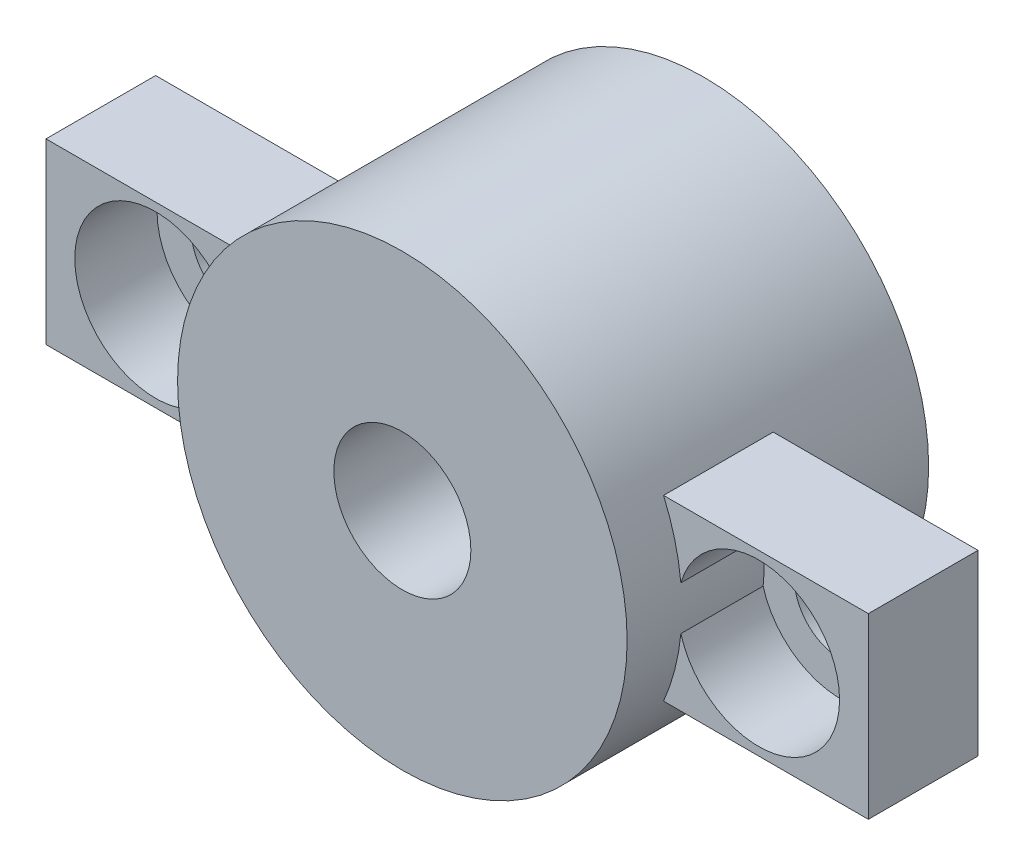
ISO-10303-21;
HEADER;
FILE_DESCRIPTION(('STEP AP214'),'2;1');
FILE_NAME('part.step','',(''),(''),'','','');
FILE_SCHEMA(('AUTOMOTIVE_DESIGN { 1 0 10303 214 1 1 1 1 }'));
ENDSEC;
DATA;
#1=APPLICATION_CONTEXT('core data for automotive mechanical design processes');
#2=APPLICATION_PROTOCOL_DEFINITION('international standard','automotive_design',2000,#1);
#3=PRODUCT_CONTEXT('',#1,'mechanical');
#4=PRODUCT('Part','Part','',(#3));
#5=PRODUCT_RELATED_PRODUCT_CATEGORY('part','',(#4));
#6=PRODUCT_DEFINITION_FORMATION('','',#4);
#7=PRODUCT_DEFINITION_CONTEXT('part definition',#1,'design');
#8=PRODUCT_DEFINITION('design','',#6,#7);
#9=PRODUCT_DEFINITION_SHAPE('','',#8);
#10=(LENGTH_UNIT() NAMED_UNIT(*) SI_UNIT(.MILLI.,.METRE.));
#11=(NAMED_UNIT(*) PLANE_ANGLE_UNIT() SI_UNIT($,.RADIAN.));
#12=(NAMED_UNIT(*) SI_UNIT($,.STERADIAN.) SOLID_ANGLE_UNIT());
#13=UNCERTAINTY_MEASURE_WITH_UNIT(LENGTH_MEASURE(1.E-05),#10,'distance_accuracy_value','');
#14=(GEOMETRIC_REPRESENTATION_CONTEXT(3) GLOBAL_UNCERTAINTY_ASSIGNED_CONTEXT((#13)) GLOBAL_UNIT_ASSIGNED_CONTEXT((#10,
#11,#12)) REPRESENTATION_CONTEXT('',''));
#15=CARTESIAN_POINT('',(0.,0.,0.));
#16=DIRECTION('',(0.,0.,1.));
#17=DIRECTION('',(1.,0.,0.));
#18=AXIS2_PLACEMENT_3D('',#15,#16,#17);
#19=CARTESIAN_POINT('',(0.,0.,-5.));
#20=DIRECTION('',(0.,0.,1.));
#21=DIRECTION('',(1.,0.,0.));
#22=AXIS2_PLACEMENT_3D('',#19,#20,#21);
#23=CYLINDRICAL_SURFACE('',#22,8.2);
#24=DIRECTION('',(0.,0.,1.));
#25=VECTOR('',#24,1.);
#26=CARTESIAN_POINT('',(7.52844605479776,-3.25,-5.));
#27=LINE('',#26,#25);
#28=CARTESIAN_POINT('',(7.52844605479776,-3.25,4.));
#29=VERTEX_POINT('',#28);
#30=CARTESIAN_POINT('',(7.52844605479776,-3.25,0.));
#31=VERTEX_POINT('',#30);
#32=EDGE_CURVE('E295',#29,#31,#27,.F.);
#33=ORIENTED_EDGE('',*,*,#32,.F.);
#34=CARTESIAN_POINT('',(0.,0.,4.));
#35=DIRECTION('',(0.,0.,1.));
#36=DIRECTION('',(1.,0.,0.));
#37=AXIS2_PLACEMENT_3D('',#34,#35,#36);
#38=CIRCLE('',#37,8.2);
#39=CARTESIAN_POINT('',(8.16079545454545,-0.800885478124209,4.));
#40=VERTEX_POINT('',#39);
#41=EDGE_CURVE('E142',#29,#40,#38,.T.);
#42=ORIENTED_EDGE('',*,*,#41,.T.);
#43=DIRECTION('',(0.,0.,1.));
#44=VECTOR('',#43,1.);
#45=CARTESIAN_POINT('',(8.16079545454545,-0.800885478124209,0.5));
#46=LINE('',#45,#44);
#47=CARTESIAN_POINT('',(8.16079545454545,-0.800885478124209,1.));
#48=VERTEX_POINT('',#47);
#49=EDGE_CURVE('E11',#48,#40,#46,.T.);
#50=ORIENTED_EDGE('',*,*,#49,.F.);
#51=CARTESIAN_POINT('',(0.,0.,1.));
#52=DIRECTION('',(0.,0.,1.));
#53=DIRECTION('',(1.,0.,0.));
#54=AXIS2_PLACEMENT_3D('',#51,#52,#53);
#55=CIRCLE('',#54,8.2);
#56=CARTESIAN_POINT('',(8.16079545454545,0.800885478124216,1.));
#57=VERTEX_POINT('',#56);
#58=EDGE_CURVE('E59',#48,#57,#55,.T.);
#59=ORIENTED_EDGE('',*,*,#58,.T.);
#60=DIRECTION('',(0.,0.,1.));
#61=VECTOR('',#60,1.);
#62=CARTESIAN_POINT('',(8.16079545454545,0.800885478124216,0.5));
#63=LINE('',#62,#61);
#64=CARTESIAN_POINT('',(8.16079545454545,0.800885478124216,4.));
#65=VERTEX_POINT('',#64);
#66=EDGE_CURVE('E44',#65,#57,#63,.F.);
#67=ORIENTED_EDGE('',*,*,#66,.F.);
#68=CARTESIAN_POINT('',(7.52844605479776,3.25,4.));
#69=VERTEX_POINT('',#68);
#70=EDGE_CURVE('E124',#65,#69,#38,.T.);
#71=ORIENTED_EDGE('',*,*,#70,.T.);
#72=DIRECTION('',(0.,0.,1.));
#73=VECTOR('',#72,1.);
#74=CARTESIAN_POINT('',(7.52844605479776,3.25,-5.));
#75=LINE('',#74,#73);
#76=CARTESIAN_POINT('',(7.52844605479776,3.25,0.));
#77=VERTEX_POINT('',#76);
#78=EDGE_CURVE('E139',#77,#69,#75,.T.);
#79=ORIENTED_EDGE('',*,*,#78,.F.);
#80=CARTESIAN_POINT('',(0.,0.,0.));
#81=DIRECTION('',(0.,0.,1.));
#82=DIRECTION('',(1.,0.,0.));
#83=AXIS2_PLACEMENT_3D('',#80,#81,#82);
#84=CIRCLE('',#83,8.2);
#85=EDGE_CURVE('E287',#31,#77,#84,.T.);
#86=ORIENTED_EDGE('',*,*,#85,.F.);
#87=EDGE_LOOP('',(#33,#42,#50,#59,#67,#71,#79,#86));
#88=FACE_BOUND('',#87,.T.);
#89=CARTESIAN_POINT('',(0.,0.,-5.));
#90=DIRECTION('',(0.,0.,1.));
#91=DIRECTION('',(1.,0.,0.));
#92=AXIS2_PLACEMENT_3D('',#89,#90,#91);
#93=CIRCLE('',#92,8.2);
#94=CARTESIAN_POINT('',(8.2,0.,-5.));
#95=VERTEX_POINT('',#94);
#96=EDGE_CURVE('E339',#95,#95,#93,.T.);
#97=ORIENTED_EDGE('',*,*,#96,.T.);
#98=EDGE_LOOP('',(#97));
#99=FACE_BOUND('',#98,.T.);
#100=CARTESIAN_POINT('',(0.,0.,6.));
#101=DIRECTION('',(0.,0.,1.));
#102=DIRECTION('',(1.,0.,0.));
#103=AXIS2_PLACEMENT_3D('',#100,#101,#102);
#104=CIRCLE('',#103,8.2);
#105=CARTESIAN_POINT('',(8.2,0.,6.));
#106=VERTEX_POINT('',#105);
#107=EDGE_CURVE('E333',#106,#106,#104,.T.);
#108=ORIENTED_EDGE('',*,*,#107,.F.);
#109=EDGE_LOOP('',(#108));
#110=FACE_BOUND('',#109,.T.);
#111=DIRECTION('',(0.,0.,1.));
#112=VECTOR('',#111,1.);
#113=CARTESIAN_POINT('',(-7.52844605479776,3.25,-5.));
#114=LINE('',#113,#112);
#115=CARTESIAN_POINT('',(-7.52844605479776,3.25,4.));
#116=VERTEX_POINT('',#115);
#117=CARTESIAN_POINT('',(-7.52844605479776,3.25,0.));
#118=VERTEX_POINT('',#117);
#119=EDGE_CURVE('E145',#116,#118,#114,.F.);
#120=ORIENTED_EDGE('',*,*,#119,.F.);
#121=CARTESIAN_POINT('',(-8.16079545454545,0.800885478124212,4.));
#122=VERTEX_POINT('',#121);
#123=EDGE_CURVE('E141',#116,#122,#38,.T.);
#124=ORIENTED_EDGE('',*,*,#123,.T.);
#125=DIRECTION('',(0.,0.,1.));
#126=VECTOR('',#125,1.);
#127=CARTESIAN_POINT('',(-8.16079545454545,0.800885478124212,0.5));
#128=LINE('',#127,#126);
#129=CARTESIAN_POINT('',(-8.16079545454545,0.800885478124212,1.));
#130=VERTEX_POINT('',#129);
#131=EDGE_CURVE('E290',#130,#122,#128,.T.);
#132=ORIENTED_EDGE('',*,*,#131,.F.);
#133=CARTESIAN_POINT('',(0.,0.,1.));
#134=DIRECTION('',(0.,0.,1.));
#135=DIRECTION('',(1.,0.,0.));
#136=AXIS2_PLACEMENT_3D('',#133,#134,#135);
#137=CIRCLE('',#136,8.2);
#138=CARTESIAN_POINT('',(-8.16079545454545,-0.800885478124214,1.));
#139=VERTEX_POINT('',#138);
#140=EDGE_CURVE('E51',#130,#139,#137,.T.);
#141=ORIENTED_EDGE('',*,*,#140,.T.);
#142=DIRECTION('',(0.,0.,1.));
#143=VECTOR('',#142,1.);
#144=CARTESIAN_POINT('',(-8.16079545454545,-0.800885478124212,0.5));
#145=LINE('',#144,#143);
#146=CARTESIAN_POINT('',(-8.16079545454545,-0.800885478124214,4.));
#147=VERTEX_POINT('',#146);
#148=EDGE_CURVE('E293',#147,#139,#145,.F.);
#149=ORIENTED_EDGE('',*,*,#148,.F.);
#150=CARTESIAN_POINT('',(-7.52844605479776,-3.25,4.));
#151=VERTEX_POINT('',#150);
#152=EDGE_CURVE('E284',#147,#151,#38,.T.);
#153=ORIENTED_EDGE('',*,*,#152,.T.);
#154=DIRECTION('',(0.,0.,1.));
#155=VECTOR('',#154,1.);
#156=CARTESIAN_POINT('',(-7.52844605479776,-3.25,-5.));
#157=LINE('',#156,#155);
#158=CARTESIAN_POINT('',(-7.52844605479776,-3.25,0.));
#159=VERTEX_POINT('',#158);
#160=EDGE_CURVE('E285',#159,#151,#157,.T.);
#161=ORIENTED_EDGE('',*,*,#160,.F.);
#162=EDGE_CURVE('E272',#118,#159,#84,.T.);
#163=ORIENTED_EDGE('',*,*,#162,.F.);
#164=EDGE_LOOP('',(#120,#124,#132,#141,#149,#153,#161,#163));
#165=FACE_BOUND('',#164,.T.);
#166=ADVANCED_FACE('F36',(#88,#99,#110,#165),#23,.T.);
#167=CARTESIAN_POINT('',(0.,0.,-5.));
#168=DIRECTION('',(0.,0.,1.));
#169=DIRECTION('',(1.,0.,0.));
#170=AXIS2_PLACEMENT_3D('',#167,#168,#169);
#171=PLANE('',#170);
#172=CARTESIAN_POINT('',(0.,0.,-5.));
#173=DIRECTION('',(0.,0.,1.));
#174=DIRECTION('',(1.,0.,0.));
#175=AXIS2_PLACEMENT_3D('',#172,#173,#174);
#176=CIRCLE('',#175,2.5);
#177=CARTESIAN_POINT('',(2.5,0.,-5.));
#178=VERTEX_POINT('',#177);
#179=EDGE_CURVE('E328',#178,#178,#176,.T.);
#180=ORIENTED_EDGE('',*,*,#179,.T.);
#181=EDGE_LOOP('',(#180));
#182=FACE_BOUND('',#181,.T.);
#183=ORIENTED_EDGE('',*,*,#96,.F.);
#184=EDGE_LOOP('',(#183));
#185=FACE_BOUND('',#184,.T.);
#186=ADVANCED_FACE('F228',(#182,#185),#171,.F.);
#187=CARTESIAN_POINT('',(0.,0.,6.));
#188=DIRECTION('',(0.,0.,1.));
#189=DIRECTION('',(1.,0.,0.));
#190=AXIS2_PLACEMENT_3D('',#187,#188,#189);
#191=PLANE('',#190);
#192=ORIENTED_EDGE('',*,*,#107,.T.);
#193=EDGE_LOOP('',(#192));
#194=FACE_BOUND('',#193,.T.);
#195=CARTESIAN_POINT('',(0.,0.,6.));
#196=DIRECTION('',(0.,0.,1.));
#197=DIRECTION('',(1.,0.,0.));
#198=AXIS2_PLACEMENT_3D('',#195,#196,#197);
#199=CIRCLE('',#198,2.5);
#200=CARTESIAN_POINT('',(2.5,0.,6.));
#201=VERTEX_POINT('',#200);
#202=EDGE_CURVE('E331',#201,#201,#199,.T.);
#203=ORIENTED_EDGE('',*,*,#202,.F.);
#204=EDGE_LOOP('',(#203));
#205=FACE_BOUND('',#204,.T.);
#206=ADVANCED_FACE('F221',(#194,#205),#191,.T.);
#207=CARTESIAN_POINT('',(15.,-3.25,4.));
#208=DIRECTION('',(-1.,0.,0.));
#209=DIRECTION('',(0.,-1.,0.));
#210=AXIS2_PLACEMENT_3D('',#207,#208,#209);
#211=PLANE('',#210);
#212=DIRECTION('',(0.,1.,0.));
#213=VECTOR('',#212,1.);
#214=CARTESIAN_POINT('',(15.,-3.25,0.));
#215=LINE('',#214,#213);
#216=CARTESIAN_POINT('',(15.,-3.25,0.));
#217=VERTEX_POINT('',#216);
#218=CARTESIAN_POINT('',(15.,3.25,0.));
#219=VERTEX_POINT('',#218);
#220=EDGE_CURVE('E183',#217,#219,#215,.T.);
#221=ORIENTED_EDGE('',*,*,#220,.T.);
#222=DIRECTION('',(0.,0.,-1.));
#223=VECTOR('',#222,1.);
#224=CARTESIAN_POINT('',(15.,3.25,4.));
#225=LINE('',#224,#223);
#226=CARTESIAN_POINT('',(15.,3.25,4.));
#227=VERTEX_POINT('',#226);
#228=EDGE_CURVE('E191',#227,#219,#225,.T.);
#229=ORIENTED_EDGE('',*,*,#228,.F.);
#230=DIRECTION('',(0.,1.,0.));
#231=VECTOR('',#230,1.);
#232=CARTESIAN_POINT('',(15.,-3.25,4.));
#233=LINE('',#232,#231);
#234=CARTESIAN_POINT('',(15.,-3.25,4.));
#235=VERTEX_POINT('',#234);
#236=EDGE_CURVE('E170',#235,#227,#233,.T.);
#237=ORIENTED_EDGE('',*,*,#236,.F.);
#238=DIRECTION('',(0.,0.,-1.));
#239=VECTOR('',#238,1.);
#240=CARTESIAN_POINT('',(15.,-3.25,4.));
#241=LINE('',#240,#239);
#242=EDGE_CURVE('E194',#235,#217,#241,.T.);
#243=ORIENTED_EDGE('',*,*,#242,.T.);
#244=EDGE_LOOP('',(#221,#229,#237,#243));
#245=FACE_BOUND('',#244,.T.);
#246=ADVANCED_FACE('F211',(#245),#211,.F.);
#247=CARTESIAN_POINT('',(11.,0.,0.));
#248=DIRECTION('',(0.,0.,1.));
#249=DIRECTION('',(1.,0.,0.));
#250=AXIS2_PLACEMENT_3D('',#247,#248,#249);
#251=CYLINDRICAL_SURFACE('',#250,1.7);
#252=CARTESIAN_POINT('',(11.,0.,0.));
#253=DIRECTION('',(0.,0.,1.));
#254=DIRECTION('',(1.,0.,0.));
#255=AXIS2_PLACEMENT_3D('',#252,#253,#254);
#256=CIRCLE('',#255,1.7);
#257=CARTESIAN_POINT('',(12.7,0.,0.));
#258=VERTEX_POINT('',#257);
#259=EDGE_CURVE('E157',#258,#258,#256,.T.);
#260=ORIENTED_EDGE('',*,*,#259,.F.);
#261=EDGE_LOOP('',(#260));
#262=FACE_BOUND('',#261,.T.);
#263=CARTESIAN_POINT('',(11.,0.,1.));
#264=DIRECTION('',(0.,0.,1.));
#265=DIRECTION('',(1.,0.,0.));
#266=AXIS2_PLACEMENT_3D('',#263,#264,#265);
#267=CIRCLE('',#266,1.7);
#268=CARTESIAN_POINT('',(12.7,0.,1.));
#269=VERTEX_POINT('',#268);
#270=EDGE_CURVE('E160',#269,#269,#267,.F.);
#271=ORIENTED_EDGE('',*,*,#270,.F.);
#272=EDGE_LOOP('',(#271));
#273=FACE_BOUND('',#272,.T.);
#274=ADVANCED_FACE('F208',(#262,#273),#251,.F.);
#275=CARTESIAN_POINT('',(15.,3.25,4.));
#276=DIRECTION('',(0.,-1.,0.));
#277=DIRECTION('',(1.,0.,0.));
#278=AXIS2_PLACEMENT_3D('',#275,#276,#277);
#279=PLANE('',#278);
#280=DIRECTION('',(-1.,0.,0.));
#281=VECTOR('',#280,1.);
#282=CARTESIAN_POINT('',(15.,3.25,0.));
#283=LINE('',#282,#281);
#284=EDGE_CURVE('E185',#219,#77,#283,.T.);
#285=ORIENTED_EDGE('',*,*,#284,.T.);
#286=ORIENTED_EDGE('',*,*,#78,.T.);
#287=DIRECTION('',(-1.,0.,0.));
#288=VECTOR('',#287,1.);
#289=CARTESIAN_POINT('',(15.,3.25,4.));
#290=LINE('',#289,#288);
#291=EDGE_CURVE('E138',#227,#69,#290,.T.);
#292=ORIENTED_EDGE('',*,*,#291,.F.);
#293=ORIENTED_EDGE('',*,*,#228,.T.);
#294=EDGE_LOOP('',(#285,#286,#292,#293));
#295=FACE_BOUND('',#294,.T.);
#296=ADVANCED_FACE('F210',(#295),#279,.F.);
#297=CARTESIAN_POINT('',(15.,-3.25,4.));
#298=DIRECTION('',(0.,1.,0.));
#299=DIRECTION('',(-1.,0.,0.));
#300=AXIS2_PLACEMENT_3D('',#297,#298,#299);
#301=PLANE('',#300);
#302=DIRECTION('',(1.,0.,0.));
#303=VECTOR('',#302,1.);
#304=CARTESIAN_POINT('',(15.,-3.25,4.));
#305=LINE('',#304,#303);
#306=EDGE_CURVE('E168',#29,#235,#305,.T.);
#307=ORIENTED_EDGE('',*,*,#306,.F.);
#308=ORIENTED_EDGE('',*,*,#32,.T.);
#309=DIRECTION('',(1.,0.,0.));
#310=VECTOR('',#309,1.);
#311=CARTESIAN_POINT('',(15.,-3.25,0.));
#312=LINE('',#311,#310);
#313=EDGE_CURVE('E181',#31,#217,#312,.T.);
#314=ORIENTED_EDGE('',*,*,#313,.T.);
#315=ORIENTED_EDGE('',*,*,#242,.F.);
#316=EDGE_LOOP('',(#307,#308,#314,#315));
#317=FACE_BOUND('',#316,.T.);
#318=ADVANCED_FACE('F218',(#317),#301,.F.);
#319=CARTESIAN_POINT('',(0.,0.,0.));
#320=DIRECTION('',(0.,0.,1.));
#321=DIRECTION('',(1.,0.,0.));
#322=AXIS2_PLACEMENT_3D('',#319,#320,#321);
#323=PLANE('',#322);
#324=ORIENTED_EDGE('',*,*,#259,.T.);
#325=EDGE_LOOP('',(#324));
#326=FACE_BOUND('',#325,.T.);
#327=ORIENTED_EDGE('',*,*,#313,.F.);
#328=ORIENTED_EDGE('',*,*,#85,.T.);
#329=ORIENTED_EDGE('',*,*,#284,.F.);
#330=ORIENTED_EDGE('',*,*,#220,.F.);
#331=EDGE_LOOP('',(#327,#328,#329,#330));
#332=FACE_BOUND('',#331,.T.);
#333=ADVANCED_FACE('F251',(#326,#332),#323,.F.);
#334=CARTESIAN_POINT('',(11.,0.,1.));
#335=DIRECTION('',(0.,0.,1.));
#336=DIRECTION('',(1.,0.,0.));
#337=AXIS2_PLACEMENT_3D('',#334,#335,#336);
#338=CYLINDRICAL_SURFACE('',#337,2.95);
#339=CARTESIAN_POINT('',(11.,0.,1.));
#340=DIRECTION('',(0.,0.,1.));
#341=DIRECTION('',(1.,0.,0.));
#342=AXIS2_PLACEMENT_3D('',#339,#340,#341);
#343=CIRCLE('',#342,2.95);
#344=EDGE_CURVE('E144',#48,#57,#343,.T.);
#345=ORIENTED_EDGE('',*,*,#344,.F.);
#346=ORIENTED_EDGE('',*,*,#49,.T.);
#347=CARTESIAN_POINT('',(11.,0.,4.));
#348=DIRECTION('',(0.,0.,1.));
#349=DIRECTION('',(1.,0.,0.));
#350=AXIS2_PLACEMENT_3D('',#347,#348,#349);
#351=CIRCLE('',#350,2.95);
#352=EDGE_CURVE('E136',#40,#65,#351,.T.);
#353=ORIENTED_EDGE('',*,*,#352,.T.);
#354=ORIENTED_EDGE('',*,*,#66,.T.);
#355=EDGE_LOOP('',(#345,#346,#353,#354));
#356=FACE_BOUND('',#355,.T.);
#357=ADVANCED_FACE('F143',(#356),#338,.F.);
#358=CARTESIAN_POINT('',(11.,0.,1.));
#359=DIRECTION('',(0.,0.,1.));
#360=DIRECTION('',(1.,0.,0.));
#361=AXIS2_PLACEMENT_3D('',#358,#359,#360);
#362=PLANE('',#361);
#363=ORIENTED_EDGE('',*,*,#58,.F.);
#364=ORIENTED_EDGE('',*,*,#344,.T.);
#365=EDGE_LOOP('',(#363,#364));
#366=FACE_BOUND('',#365,.T.);
#367=ORIENTED_EDGE('',*,*,#270,.T.);
#368=EDGE_LOOP('',(#367));
#369=FACE_BOUND('',#368,.T.);
#370=ADVANCED_FACE('F206',(#366,#369),#362,.T.);
#371=CARTESIAN_POINT('',(0.,0.,4.));
#372=DIRECTION('',(0.,0.,1.));
#373=DIRECTION('',(1.,0.,0.));
#374=AXIS2_PLACEMENT_3D('',#371,#372,#373);
#375=PLANE('',#374);
#376=ORIENTED_EDGE('',*,*,#70,.F.);
#377=ORIENTED_EDGE('',*,*,#352,.F.);
#378=ORIENTED_EDGE('',*,*,#41,.F.);
#379=ORIENTED_EDGE('',*,*,#306,.T.);
#380=ORIENTED_EDGE('',*,*,#236,.T.);
#381=ORIENTED_EDGE('',*,*,#291,.T.);
#382=EDGE_LOOP('',(#376,#377,#378,#379,#380,#381));
#383=FACE_BOUND('',#382,.T.);
#384=ADVANCED_FACE('F134',(#383),#375,.T.);
#385=CARTESIAN_POINT('',(-15.,-3.25,4.));
#386=DIRECTION('',(1.,0.,0.));
#387=DIRECTION('',(0.,0.,-1.));
#388=AXIS2_PLACEMENT_3D('',#385,#386,#387);
#389=PLANE('',#388);
#390=DIRECTION('',(0.,-1.,0.));
#391=VECTOR('',#390,1.);
#392=CARTESIAN_POINT('',(-15.,-3.25,0.));
#393=LINE('',#392,#391);
#394=CARTESIAN_POINT('',(-15.,3.25,0.));
#395=VERTEX_POINT('',#394);
#396=CARTESIAN_POINT('',(-15.,-3.25,0.));
#397=VERTEX_POINT('',#396);
#398=EDGE_CURVE('E156',#395,#397,#393,.T.);
#399=ORIENTED_EDGE('',*,*,#398,.T.);
#400=DIRECTION('',(0.,0.,-1.));
#401=VECTOR('',#400,1.);
#402=CARTESIAN_POINT('',(-15.,-3.25,4.));
#403=LINE('',#402,#401);
#404=CARTESIAN_POINT('',(-15.,-3.25,4.));
#405=VERTEX_POINT('',#404);
#406=EDGE_CURVE('E130',#405,#397,#403,.T.);
#407=ORIENTED_EDGE('',*,*,#406,.F.);
#408=DIRECTION('',(0.,-1.,0.));
#409=VECTOR('',#408,1.);
#410=CARTESIAN_POINT('',(-15.,-3.25,4.));
#411=LINE('',#410,#409);
#412=CARTESIAN_POINT('',(-15.,3.25,4.));
#413=VERTEX_POINT('',#412);
#414=EDGE_CURVE('E161',#413,#405,#411,.T.);
#415=ORIENTED_EDGE('',*,*,#414,.F.);
#416=DIRECTION('',(0.,0.,-1.));
#417=VECTOR('',#416,1.);
#418=CARTESIAN_POINT('',(-15.,3.25,4.));
#419=LINE('',#418,#417);
#420=EDGE_CURVE('E175',#413,#395,#419,.T.);
#421=ORIENTED_EDGE('',*,*,#420,.T.);
#422=EDGE_LOOP('',(#399,#407,#415,#421));
#423=FACE_BOUND('',#422,.T.);
#424=ADVANCED_FACE('F38',(#423),#389,.F.);
#425=CARTESIAN_POINT('',(-11.,0.,0.));
#426=DIRECTION('',(0.,0.,1.));
#427=DIRECTION('',(1.,0.,0.));
#428=AXIS2_PLACEMENT_3D('',#425,#426,#427);
#429=CYLINDRICAL_SURFACE('',#428,1.7);
#430=CARTESIAN_POINT('',(-11.,0.,0.));
#431=DIRECTION('',(0.,0.,1.));
#432=DIRECTION('',(1.,0.,0.));
#433=AXIS2_PLACEMENT_3D('',#430,#431,#432);
#434=CIRCLE('',#433,1.7);
#435=CARTESIAN_POINT('',(-9.3,0.,0.));
#436=VERTEX_POINT('',#435);
#437=EDGE_CURVE('E153',#436,#436,#434,.T.);
#438=ORIENTED_EDGE('',*,*,#437,.F.);
#439=EDGE_LOOP('',(#438));
#440=FACE_BOUND('',#439,.T.);
#441=CARTESIAN_POINT('',(-11.,0.,1.));
#442=DIRECTION('',(0.,0.,1.));
#443=DIRECTION('',(1.,0.,0.));
#444=AXIS2_PLACEMENT_3D('',#441,#442,#443);
#445=CIRCLE('',#444,1.7);
#446=CARTESIAN_POINT('',(-9.3,0.,1.));
#447=VERTEX_POINT('',#446);
#448=EDGE_CURVE('E199',#447,#447,#445,.F.);
#449=ORIENTED_EDGE('',*,*,#448,.F.);
#450=EDGE_LOOP('',(#449));
#451=FACE_BOUND('',#450,.T.);
#452=ADVANCED_FACE('F245',(#440,#451),#429,.F.);
#453=CARTESIAN_POINT('',(-11.,0.,1.));
#454=DIRECTION('',(0.,0.,1.));
#455=DIRECTION('',(1.,0.,0.));
#456=AXIS2_PLACEMENT_3D('',#453,#454,#455);
#457=CYLINDRICAL_SURFACE('',#456,2.95);
#458=CARTESIAN_POINT('',(-11.,0.,1.));
#459=DIRECTION('',(0.,0.,1.));
#460=DIRECTION('',(1.,0.,0.));
#461=AXIS2_PLACEMENT_3D('',#458,#459,#460);
#462=CIRCLE('',#461,2.95);
#463=EDGE_CURVE('E202',#130,#139,#462,.T.);
#464=ORIENTED_EDGE('',*,*,#463,.F.);
#465=ORIENTED_EDGE('',*,*,#131,.T.);
#466=CARTESIAN_POINT('',(-11.,0.,4.));
#467=DIRECTION('',(0.,0.,1.));
#468=DIRECTION('',(1.,0.,0.));
#469=AXIS2_PLACEMENT_3D('',#466,#467,#468);
#470=CIRCLE('',#469,2.95);
#471=EDGE_CURVE('E147',#122,#147,#470,.T.);
#472=ORIENTED_EDGE('',*,*,#471,.T.);
#473=ORIENTED_EDGE('',*,*,#148,.T.);
#474=EDGE_LOOP('',(#464,#465,#472,#473));
#475=FACE_BOUND('',#474,.T.);
#476=ADVANCED_FACE('F241',(#475),#457,.F.);
#477=CARTESIAN_POINT('',(-11.,0.,1.));
#478=DIRECTION('',(0.,0.,1.));
#479=DIRECTION('',(1.,0.,0.));
#480=AXIS2_PLACEMENT_3D('',#477,#478,#479);
#481=PLANE('',#480);
#482=ORIENTED_EDGE('',*,*,#140,.F.);
#483=ORIENTED_EDGE('',*,*,#463,.T.);
#484=EDGE_LOOP('',(#482,#483));
#485=FACE_BOUND('',#484,.T.);
#486=ORIENTED_EDGE('',*,*,#448,.T.);
#487=EDGE_LOOP('',(#486));
#488=FACE_BOUND('',#487,.T.);
#489=ADVANCED_FACE('F237',(#485,#488),#481,.T.);
#490=CARTESIAN_POINT('',(-7.20052081449669,-3.25,4.));
#491=DIRECTION('',(0.,1.,0.));
#492=DIRECTION('',(-1.,0.,0.));
#493=AXIS2_PLACEMENT_3D('',#490,#491,#492);
#494=PLANE('',#493);
#495=DIRECTION('',(1.,0.,0.));
#496=VECTOR('',#495,1.);
#497=CARTESIAN_POINT('',(-7.20052081449669,-3.25,0.));
#498=LINE('',#497,#496);
#499=EDGE_CURVE('E178',#397,#159,#498,.T.);
#500=ORIENTED_EDGE('',*,*,#499,.T.);
#501=ORIENTED_EDGE('',*,*,#160,.T.);
#502=DIRECTION('',(1.,0.,0.));
#503=VECTOR('',#502,1.);
#504=CARTESIAN_POINT('',(-7.20052081449669,-3.25,4.));
#505=LINE('',#504,#503);
#506=EDGE_CURVE('E164',#405,#151,#505,.T.);
#507=ORIENTED_EDGE('',*,*,#506,.F.);
#508=ORIENTED_EDGE('',*,*,#406,.T.);
#509=EDGE_LOOP('',(#500,#501,#507,#508));
#510=FACE_BOUND('',#509,.T.);
#511=ADVANCED_FACE('F240',(#510),#494,.F.);
#512=CARTESIAN_POINT('',(-7.20052081449669,3.25,4.));
#513=DIRECTION('',(0.,-1.,0.));
#514=DIRECTION('',(1.,0.,0.));
#515=AXIS2_PLACEMENT_3D('',#512,#513,#514);
#516=PLANE('',#515);
#517=DIRECTION('',(-1.,0.,0.));
#518=VECTOR('',#517,1.);
#519=CARTESIAN_POINT('',(-7.20052081449669,3.25,4.));
#520=LINE('',#519,#518);
#521=EDGE_CURVE('E173',#116,#413,#520,.T.);
#522=ORIENTED_EDGE('',*,*,#521,.F.);
#523=ORIENTED_EDGE('',*,*,#119,.T.);
#524=DIRECTION('',(-1.,0.,0.));
#525=VECTOR('',#524,1.);
#526=CARTESIAN_POINT('',(-7.20052081449669,3.25,0.));
#527=LINE('',#526,#525);
#528=EDGE_CURVE('E165',#118,#395,#527,.T.);
#529=ORIENTED_EDGE('',*,*,#528,.T.);
#530=ORIENTED_EDGE('',*,*,#420,.F.);
#531=EDGE_LOOP('',(#522,#523,#529,#530));
#532=FACE_BOUND('',#531,.T.);
#533=ADVANCED_FACE('F267',(#532),#516,.F.);
#534=ORIENTED_EDGE('',*,*,#437,.T.);
#535=EDGE_LOOP('',(#534));
#536=FACE_BOUND('',#535,.T.);
#537=ORIENTED_EDGE('',*,*,#528,.F.);
#538=ORIENTED_EDGE('',*,*,#162,.T.);
#539=ORIENTED_EDGE('',*,*,#499,.F.);
#540=ORIENTED_EDGE('',*,*,#398,.F.);
#541=EDGE_LOOP('',(#537,#538,#539,#540));
#542=FACE_BOUND('',#541,.T.);
#543=ADVANCED_FACE('F263',(#536,#542),#323,.F.);
#544=ORIENTED_EDGE('',*,*,#123,.F.);
#545=ORIENTED_EDGE('',*,*,#521,.T.);
#546=ORIENTED_EDGE('',*,*,#414,.T.);
#547=ORIENTED_EDGE('',*,*,#506,.T.);
#548=ORIENTED_EDGE('',*,*,#152,.F.);
#549=ORIENTED_EDGE('',*,*,#471,.F.);
#550=EDGE_LOOP('',(#544,#545,#546,#547,#548,#549));
#551=FACE_BOUND('',#550,.T.);
#552=ADVANCED_FACE('F266',(#551),#375,.T.);
#553=CARTESIAN_POINT('',(0.,0.,4.));
#554=DIRECTION('',(0.,0.,-1.));
#555=DIRECTION('',(-1.,0.,0.));
#556=AXIS2_PLACEMENT_3D('',#553,#554,#555);
#557=CYLINDRICAL_SURFACE('',#556,2.5);
#558=ORIENTED_EDGE('',*,*,#179,.F.);
#559=EDGE_LOOP('',(#558));
#560=FACE_BOUND('',#559,.T.);
#561=ORIENTED_EDGE('',*,*,#202,.T.);
#562=EDGE_LOOP('',(#561));
#563=FACE_BOUND('',#562,.T.);
#564=ADVANCED_FACE('F320',(#560,#563),#557,.F.);
#565=CLOSED_SHELL('',(#166,#186,#206,#246,#274,#296,#318,#333,#357,#370,#384,#424,#452,#476,
#489,#511,#533,#543,#552,#564));
#566=MANIFOLD_SOLID_BREP('B2',#565);
#567=ADVANCED_BREP_SHAPE_REPRESENTATION('',(#18,#566),#14);
#568=SHAPE_DEFINITION_REPRESENTATION(#9,#567);
ENDSEC;
END-ISO-10303-21;
